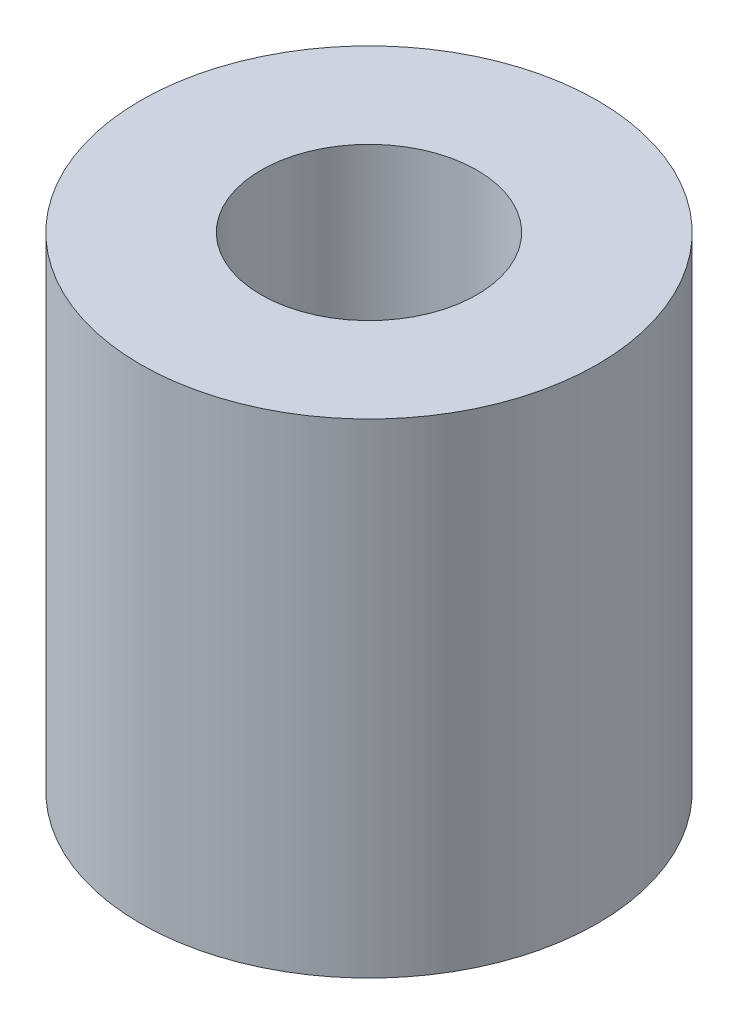
ISO-10303-21;
HEADER;
FILE_DESCRIPTION(('STEP AP214'),'2;1');
FILE_NAME('part.step','',(''),(''),'','','');
FILE_SCHEMA(('AUTOMOTIVE_DESIGN { 1 0 10303 214 1 1 1 1 }'));
ENDSEC;
DATA;
#1=APPLICATION_CONTEXT('core data for automotive mechanical design processes');
#2=APPLICATION_PROTOCOL_DEFINITION('international standard','automotive_design',2000,#1);
#3=PRODUCT_CONTEXT('',#1,'mechanical');
#4=PRODUCT('Part','Part','',(#3));
#5=PRODUCT_RELATED_PRODUCT_CATEGORY('part','',(#4));
#6=PRODUCT_DEFINITION_FORMATION('','',#4);
#7=PRODUCT_DEFINITION_CONTEXT('part definition',#1,'design');
#8=PRODUCT_DEFINITION('design','',#6,#7);
#9=PRODUCT_DEFINITION_SHAPE('','',#8);
#10=(LENGTH_UNIT() NAMED_UNIT(*) SI_UNIT(.MILLI.,.METRE.));
#11=(NAMED_UNIT(*) PLANE_ANGLE_UNIT() SI_UNIT($,.RADIAN.));
#12=(NAMED_UNIT(*) SI_UNIT($,.STERADIAN.) SOLID_ANGLE_UNIT());
#13=UNCERTAINTY_MEASURE_WITH_UNIT(LENGTH_MEASURE(1.E-05),#10,'distance_accuracy_value','');
#14=(GEOMETRIC_REPRESENTATION_CONTEXT(3) GLOBAL_UNCERTAINTY_ASSIGNED_CONTEXT((#13)) GLOBAL_UNIT_ASSIGNED_CONTEXT((#10,
#11,#12)) REPRESENTATION_CONTEXT('',''));
#15=CARTESIAN_POINT('',(0.,0.,0.));
#16=DIRECTION('',(0.,0.,1.));
#17=DIRECTION('',(1.,0.,0.));
#18=AXIS2_PLACEMENT_3D('',#15,#16,#17);
#19=CARTESIAN_POINT('',(0.,9.64,0.));
#20=DIRECTION('',(0.,1.,0.));
#21=DIRECTION('',(0.,0.,1.));
#22=AXIS2_PLACEMENT_3D('',#19,#20,#21);
#23=PLANE('',#22);
#24=CARTESIAN_POINT('',(0.,9.64,0.));
#25=DIRECTION('',(0.,1.,0.));
#26=DIRECTION('',(0.,0.,1.));
#27=AXIS2_PLACEMENT_3D('',#24,#25,#26);
#28=CIRCLE('',#27,4.55);
#29=CARTESIAN_POINT('',(0.,9.64,4.55));
#30=VERTEX_POINT('',#29);
#31=EDGE_CURVE('E10',#30,#30,#28,.T.);
#32=ORIENTED_EDGE('',*,*,#31,.T.);
#33=EDGE_LOOP('',(#32));
#34=FACE_BOUND('',#33,.T.);
#35=CARTESIAN_POINT('',(0.,9.64,0.));
#36=DIRECTION('',(0.,1.,0.));
#37=DIRECTION('',(0.,0.,1.));
#38=AXIS2_PLACEMENT_3D('',#35,#36,#37);
#39=CIRCLE('',#38,2.15);
#40=CARTESIAN_POINT('',(0.,9.64,2.15));
#41=VERTEX_POINT('',#40);
#42=EDGE_CURVE('E50',#41,#41,#39,.T.);
#43=ORIENTED_EDGE('',*,*,#42,.F.);
#44=EDGE_LOOP('',(#43));
#45=FACE_BOUND('',#44,.T.);
#46=ADVANCED_FACE('F37',(#34,#45),#23,.T.);
#47=CARTESIAN_POINT('',(0.,0.,0.));
#48=DIRECTION('',(0.,1.,0.));
#49=DIRECTION('',(0.,0.,1.));
#50=AXIS2_PLACEMENT_3D('',#47,#48,#49);
#51=PLANE('',#50);
#52=CARTESIAN_POINT('',(0.,0.,0.));
#53=DIRECTION('',(0.,1.,0.));
#54=DIRECTION('',(0.,0.,1.));
#55=AXIS2_PLACEMENT_3D('',#52,#53,#54);
#56=CIRCLE('',#55,4.55);
#57=CARTESIAN_POINT('',(0.,0.,4.55));
#58=VERTEX_POINT('',#57);
#59=EDGE_CURVE('E41',#58,#58,#56,.T.);
#60=ORIENTED_EDGE('',*,*,#59,.F.);
#61=EDGE_LOOP('',(#60));
#62=FACE_BOUND('',#61,.T.);
#63=CARTESIAN_POINT('',(0.,0.,0.));
#64=DIRECTION('',(0.,1.,0.));
#65=DIRECTION('',(0.,0.,1.));
#66=AXIS2_PLACEMENT_3D('',#63,#64,#65);
#67=CIRCLE('',#66,2.15);
#68=CARTESIAN_POINT('',(0.,0.,2.15));
#69=VERTEX_POINT('',#68);
#70=EDGE_CURVE('E52',#69,#69,#67,.T.);
#71=ORIENTED_EDGE('',*,*,#70,.T.);
#72=EDGE_LOOP('',(#71));
#73=FACE_BOUND('',#72,.T.);
#74=ADVANCED_FACE('F64',(#62,#73),#51,.F.);
#75=CARTESIAN_POINT('',(0.,9.64,0.));
#76=DIRECTION('',(0.,-1.,0.));
#77=DIRECTION('',(0.,0.,-1.));
#78=AXIS2_PLACEMENT_3D('',#75,#76,#77);
#79=CYLINDRICAL_SURFACE('',#78,4.55);
#80=ORIENTED_EDGE('',*,*,#31,.F.);
#81=EDGE_LOOP('',(#80));
#82=FACE_BOUND('',#81,.T.);
#83=ORIENTED_EDGE('',*,*,#59,.T.);
#84=EDGE_LOOP('',(#83));
#85=FACE_BOUND('',#84,.T.);
#86=ADVANCED_FACE('F39',(#82,#85),#79,.T.);
#87=CARTESIAN_POINT('',(0.,9.64,0.));
#88=DIRECTION('',(0.,-1.,0.));
#89=DIRECTION('',(0.,0.,-1.));
#90=AXIS2_PLACEMENT_3D('',#87,#88,#89);
#91=CYLINDRICAL_SURFACE('',#90,2.15);
#92=ORIENTED_EDGE('',*,*,#42,.T.);
#93=EDGE_LOOP('',(#92));
#94=FACE_BOUND('',#93,.T.);
#95=ORIENTED_EDGE('',*,*,#70,.F.);
#96=EDGE_LOOP('',(#95));
#97=FACE_BOUND('',#96,.T.);
#98=ADVANCED_FACE('F60',(#94,#97),#91,.F.);
#99=CLOSED_SHELL('',(#46,#74,#86,#98));
#100=MANIFOLD_SOLID_BREP('B2',#99);
#101=ADVANCED_BREP_SHAPE_REPRESENTATION('',(#18,#100),#14);
#102=SHAPE_DEFINITION_REPRESENTATION(#9,#101);
ENDSEC;
END-ISO-10303-21;
